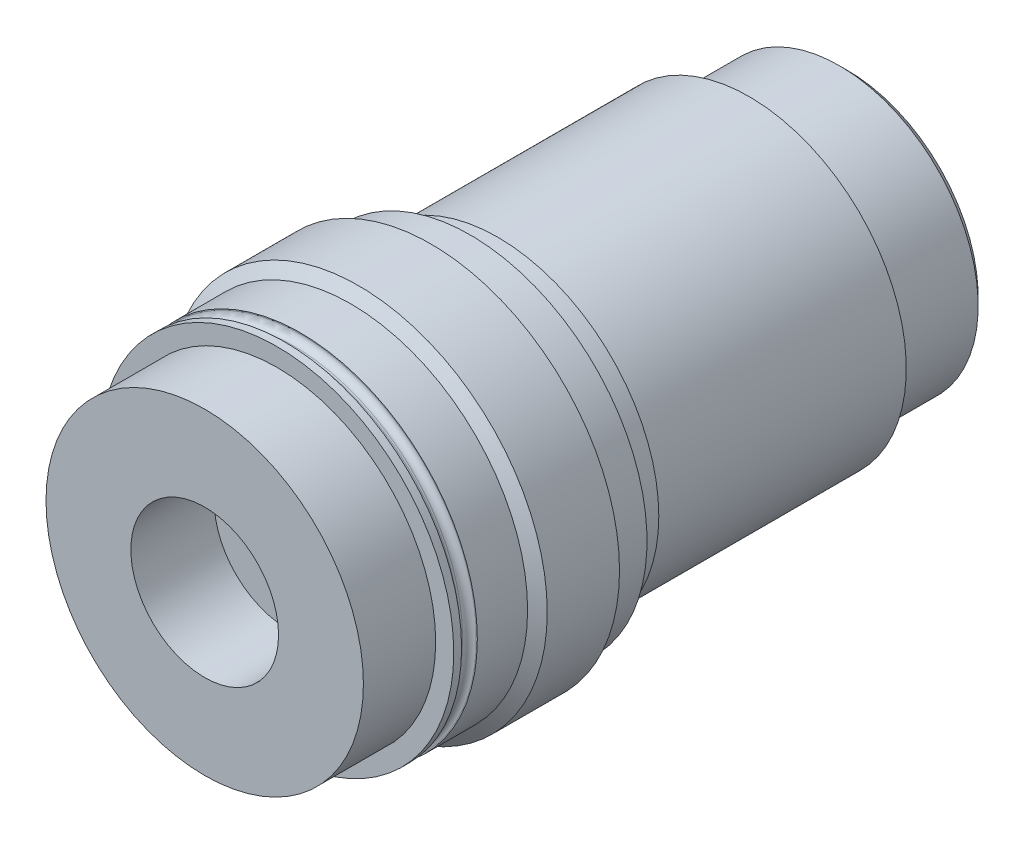
ISO-10303-21;
HEADER;
FILE_DESCRIPTION(('STEP AP214'),'2;1');
FILE_NAME('part.step','',(''),(''),'','','');
FILE_SCHEMA(('AUTOMOTIVE_DESIGN { 1 0 10303 214 1 1 1 1 }'));
ENDSEC;
DATA;
#1=APPLICATION_CONTEXT('core data for automotive mechanical design processes');
#2=APPLICATION_PROTOCOL_DEFINITION('international standard','automotive_design',2000,#1);
#3=PRODUCT_CONTEXT('',#1,'mechanical');
#4=PRODUCT('Part','Part','',(#3));
#5=PRODUCT_RELATED_PRODUCT_CATEGORY('part','',(#4));
#6=PRODUCT_DEFINITION_FORMATION('','',#4);
#7=PRODUCT_DEFINITION_CONTEXT('part definition',#1,'design');
#8=PRODUCT_DEFINITION('design','',#6,#7);
#9=PRODUCT_DEFINITION_SHAPE('','',#8);
#10=(LENGTH_UNIT() NAMED_UNIT(*) SI_UNIT(.MILLI.,.METRE.));
#11=(NAMED_UNIT(*) PLANE_ANGLE_UNIT() SI_UNIT($,.RADIAN.));
#12=(NAMED_UNIT(*) SI_UNIT($,.STERADIAN.) SOLID_ANGLE_UNIT());
#13=UNCERTAINTY_MEASURE_WITH_UNIT(LENGTH_MEASURE(1.E-05),#10,'distance_accuracy_value','');
#14=(GEOMETRIC_REPRESENTATION_CONTEXT(3) GLOBAL_UNCERTAINTY_ASSIGNED_CONTEXT((#13)) GLOBAL_UNIT_ASSIGNED_CONTEXT((#10,
#11,#12)) REPRESENTATION_CONTEXT('',''));
#15=CARTESIAN_POINT('',(0.,0.,0.));
#16=DIRECTION('',(0.,0.,1.));
#17=DIRECTION('',(1.,0.,0.));
#18=AXIS2_PLACEMENT_3D('',#15,#16,#17);
#19=CARTESIAN_POINT('',(60.0000008940697,0.,42.9));
#20=DIRECTION('',(0.,0.,1.));
#21=DIRECTION('',(1.,0.,0.));
#22=AXIS2_PLACEMENT_3D('',#19,#20,#21);
#23=PLANE('',#22);
#24=CARTESIAN_POINT('',(60.0000008940697,0.,42.9));
#25=DIRECTION('',(0.,0.,-1.));
#26=DIRECTION('',(-1.,0.,0.));
#27=AXIS2_PLACEMENT_3D('',#24,#25,#26);
#28=CIRCLE('',#27,4.7);
#29=CARTESIAN_POINT('',(64.7000008940697,0.,42.9));
#30=VERTEX_POINT('',#29);
#31=EDGE_CURVE('E254',#30,#30,#28,.T.);
#32=ORIENTED_EDGE('',*,*,#31,.T.);
#33=EDGE_LOOP('',(#32));
#34=FACE_BOUND('',#33,.T.);
#35=CARTESIAN_POINT('',(60.0000008940697,0.,42.9));
#36=DIRECTION('',(0.,0.,1.));
#37=DIRECTION('',(-1.,0.,0.));
#38=AXIS2_PLACEMENT_3D('',#35,#36,#37);
#39=CIRCLE('',#38,10.1);
#40=CARTESIAN_POINT('',(70.1000008940697,0.,42.9));
#41=VERTEX_POINT('',#40);
#42=EDGE_CURVE('E244',#41,#41,#39,.T.);
#43=ORIENTED_EDGE('',*,*,#42,.T.);
#44=EDGE_LOOP('',(#43));
#45=FACE_BOUND('',#44,.T.);
#46=ADVANCED_FACE('F16',(#34,#45),#23,.T.);
#47=CARTESIAN_POINT('',(60.0000008940697,0.,38.3));
#48=DIRECTION('',(0.,0.,1.));
#49=DIRECTION('',(1.,0.,0.));
#50=AXIS2_PLACEMENT_3D('',#47,#48,#49);
#51=PLANE('',#50);
#52=CARTESIAN_POINT('',(60.0000008940697,0.,38.3));
#53=DIRECTION('',(0.,0.,1.));
#54=DIRECTION('',(-1.,0.,0.));
#55=AXIS2_PLACEMENT_3D('',#52,#53,#54);
#56=CIRCLE('',#55,10.1);
#57=CARTESIAN_POINT('',(70.1000008940697,0.,38.3));
#58=VERTEX_POINT('',#57);
#59=EDGE_CURVE('E11',#58,#58,#56,.T.);
#60=ORIENTED_EDGE('',*,*,#59,.F.);
#61=EDGE_LOOP('',(#60));
#62=FACE_BOUND('',#61,.T.);
#63=CARTESIAN_POINT('',(60.0000008940697,0.,38.3));
#64=DIRECTION('',(0.,0.,1.));
#65=DIRECTION('',(-1.,0.,0.));
#66=AXIS2_PLACEMENT_3D('',#63,#64,#65);
#67=CIRCLE('',#66,11.25);
#68=CARTESIAN_POINT('',(71.2500008940697,0.,38.3));
#69=VERTEX_POINT('',#68);
#70=EDGE_CURVE('E255',#69,#69,#67,.T.);
#71=ORIENTED_EDGE('',*,*,#70,.T.);
#72=EDGE_LOOP('',(#71));
#73=FACE_BOUND('',#72,.T.);
#74=ADVANCED_FACE('F560',(#62,#73),#51,.T.);
#75=CARTESIAN_POINT('',(60.0000008940697,0.,42.9));
#76=DIRECTION('',(0.,0.,-1.));
#77=DIRECTION('',(-1.,0.,0.));
#78=AXIS2_PLACEMENT_3D('',#75,#76,#77);
#79=CYLINDRICAL_SURFACE('',#78,10.1);
#80=ORIENTED_EDGE('',*,*,#42,.F.);
#81=DIRECTION('',(0.,0.,-1.));
#82=VECTOR('',#81,1.);
#83=CARTESIAN_POINT('',(70.1000008940697,0.,42.9));
#84=LINE('',#83,#82);
#85=EDGE_CURVE('E27',#41,#58,#84,.T.);
#86=ORIENTED_EDGE('',*,*,#85,.T.);
#87=ORIENTED_EDGE('',*,*,#59,.T.);
#88=ORIENTED_EDGE('',*,*,#85,.F.);
#89=EDGE_LOOP('',(#80,#86,#87,#88));
#90=FACE_BOUND('',#89,.T.);
#91=ADVANCED_FACE('F555',(#90),#79,.T.);
#92=CARTESIAN_POINT('',(60.0000008940697,0.,37.594));
#93=DIRECTION('',(0.,0.,1.));
#94=DIRECTION('',(1.,0.,0.));
#95=AXIS2_PLACEMENT_3D('',#92,#93,#94);
#96=PLANE('',#95);
#97=CARTESIAN_POINT('',(60.0000008940697,0.,37.594));
#98=DIRECTION('',(0.,0.,-1.));
#99=DIRECTION('',(-1.,0.,0.));
#100=AXIS2_PLACEMENT_3D('',#97,#98,#99);
#101=CIRCLE('',#100,4.7);
#102=CARTESIAN_POINT('',(64.7000008940697,0.,37.594));
#103=VERTEX_POINT('',#102);
#104=EDGE_CURVE('E280',#103,#103,#101,.T.);
#105=ORIENTED_EDGE('',*,*,#104,.F.);
#106=EDGE_LOOP('',(#105));
#107=FACE_BOUND('',#106,.T.);
#108=ADVANCED_FACE('F546',(#107),#96,.T.);
#109=CARTESIAN_POINT('',(60.0000008940697,0.,42.9));
#110=DIRECTION('',(0.,0.,-1.));
#111=DIRECTION('',(-1.,0.,0.));
#112=AXIS2_PLACEMENT_3D('',#109,#110,#111);
#113=CYLINDRICAL_SURFACE('',#112,4.7);
#114=ORIENTED_EDGE('',*,*,#31,.F.);
#115=DIRECTION('',(0.,0.,-1.));
#116=VECTOR('',#115,1.);
#117=CARTESIAN_POINT('',(64.7000008940697,0.,42.9));
#118=LINE('',#117,#116);
#119=EDGE_CURVE('E266',#30,#103,#118,.T.);
#120=ORIENTED_EDGE('',*,*,#119,.T.);
#121=ORIENTED_EDGE('',*,*,#104,.T.);
#122=ORIENTED_EDGE('',*,*,#119,.F.);
#123=EDGE_LOOP('',(#114,#120,#121,#122));
#124=FACE_BOUND('',#123,.T.);
#125=ADVANCED_FACE('F540',(#124),#113,.F.);
#126=CARTESIAN_POINT('',(60.0000008940697,0.,42.9));
#127=DIRECTION('',(0.,0.,-1.));
#128=DIRECTION('',(-1.,0.,0.));
#129=AXIS2_PLACEMENT_3D('',#126,#127,#128);
#130=CYLINDRICAL_SURFACE('',#129,11.25);
#131=ORIENTED_EDGE('',*,*,#70,.F.);
#132=DIRECTION('',(0.,0.,-1.));
#133=VECTOR('',#132,1.);
#134=CARTESIAN_POINT('',(71.2500008940697,0.,42.9));
#135=LINE('',#134,#133);
#136=CARTESIAN_POINT('',(71.2500008940697,0.,37.8));
#137=VERTEX_POINT('',#136);
#138=EDGE_CURVE('E251',#69,#137,#135,.T.);
#139=ORIENTED_EDGE('',*,*,#138,.T.);
#140=CARTESIAN_POINT('',(60.0000008940697,0.,37.8));
#141=DIRECTION('',(0.,0.,1.));
#142=DIRECTION('',(-1.,0.,0.));
#143=AXIS2_PLACEMENT_3D('',#140,#141,#142);
#144=CIRCLE('',#143,11.25);
#145=EDGE_CURVE('E202',#137,#137,#144,.T.);
#146=ORIENTED_EDGE('',*,*,#145,.T.);
#147=ORIENTED_EDGE('',*,*,#138,.F.);
#148=EDGE_LOOP('',(#131,#139,#146,#147));
#149=FACE_BOUND('',#148,.T.);
#150=ADVANCED_FACE('F545',(#149),#130,.T.);
#151=CARTESIAN_POINT('',(60.0000008940697,0.,33.35));
#152=DIRECTION('',(0.,0.,-1.));
#153=DIRECTION('',(1.,0.,0.));
#154=AXIS2_PLACEMENT_3D('',#151,#152,#153);
#155=CONICAL_SURFACE('',#154,11.625,0.982793723247332);
#156=CARTESIAN_POINT('',(60.0000008940697,0.,33.1));
#157=DIRECTION('',(0.,0.,1.));
#158=DIRECTION('',(1.,0.,0.));
#159=AXIS2_PLACEMENT_3D('',#156,#157,#158);
#160=CIRCLE('',#159,12.);
#161=CARTESIAN_POINT('',(48.0000008940697,0.,33.1));
#162=VERTEX_POINT('',#161);
#163=EDGE_CURVE('E198',#162,#162,#160,.T.);
#164=ORIENTED_EDGE('',*,*,#163,.T.);
#165=DIRECTION('',(0.832050294337845,0.,0.554700196225227));
#166=VECTOR('',#165,1.);
#167=CARTESIAN_POINT('',(48.3750008940697,0.,33.35));
#168=LINE('',#167,#166);
#169=CARTESIAN_POINT('',(48.7500008940697,0.,33.6));
#170=VERTEX_POINT('',#169);
#171=EDGE_CURVE('E220',#162,#170,#168,.T.);
#172=ORIENTED_EDGE('',*,*,#171,.T.);
#173=CARTESIAN_POINT('',(60.0000008940697,0.,33.6));
#174=DIRECTION('',(0.,0.,1.));
#175=DIRECTION('',(-1.,0.,0.));
#176=AXIS2_PLACEMENT_3D('',#173,#174,#175);
#177=CIRCLE('',#176,11.25);
#178=CARTESIAN_POINT('',(71.2500008940697,0.,33.6));
#179=VERTEX_POINT('',#178);
#180=EDGE_CURVE('E216',#179,#170,#177,.T.);
#181=ORIENTED_EDGE('',*,*,#180,.F.);
#182=CARTESIAN_POINT('',(60.0000008940697,0.,33.6));
#183=DIRECTION('',(0.,0.,1.));
#184=DIRECTION('',(-1.,0.,0.));
#185=AXIS2_PLACEMENT_3D('',#182,#183,#184);
#186=CIRCLE('',#185,11.25);
#187=EDGE_CURVE('E217',#170,#179,#186,.T.);
#188=ORIENTED_EDGE('',*,*,#187,.F.);
#189=ORIENTED_EDGE('',*,*,#171,.F.);
#190=EDGE_LOOP('',(#164,#172,#181,#188,#189));
#191=FACE_BOUND('',#190,.T.);
#192=ADVANCED_FACE('F376',(#191),#155,.T.);
#193=CARTESIAN_POINT('',(60.0000008940697,0.,42.9));
#194=DIRECTION('',(0.,0.,-1.));
#195=DIRECTION('',(-1.,0.,0.));
#196=AXIS2_PLACEMENT_3D('',#193,#194,#195);
#197=CYLINDRICAL_SURFACE('',#196,11.25);
#198=CARTESIAN_POINT('',(60.0000008940697,0.,36.8));
#199=DIRECTION('',(0.,0.,-1.));
#200=DIRECTION('',(-1.,0.,0.));
#201=AXIS2_PLACEMENT_3D('',#198,#199,#200);
#202=CIRCLE('',#201,11.25);
#203=CARTESIAN_POINT('',(71.2500008940697,0.,36.8));
#204=VERTEX_POINT('',#203);
#205=EDGE_CURVE('E240',#204,#204,#202,.T.);
#206=ORIENTED_EDGE('',*,*,#205,.T.);
#207=DIRECTION('',(0.,0.,-1.));
#208=VECTOR('',#207,1.);
#209=CARTESIAN_POINT('',(71.2500008940697,0.,42.9));
#210=LINE('',#209,#208);
#211=EDGE_CURVE('E212',#204,#179,#210,.T.);
#212=ORIENTED_EDGE('',*,*,#211,.T.);
#213=ORIENTED_EDGE('',*,*,#180,.T.);
#214=ORIENTED_EDGE('',*,*,#187,.T.);
#215=ORIENTED_EDGE('',*,*,#211,.F.);
#216=EDGE_LOOP('',(#206,#212,#213,#214,#215));
#217=FACE_BOUND('',#216,.T.);
#218=ADVANCED_FACE('F371',(#217),#197,.T.);
#219=CARTESIAN_POINT('',(60.0000008940697,0.,37.8));
#220=DIRECTION('',(0.,0.,1.));
#221=DIRECTION('',(1.,0.,0.));
#222=AXIS2_PLACEMENT_3D('',#219,#220,#221);
#223=PLANE('',#222);
#224=CARTESIAN_POINT('',(60.0000008940697,0.,37.8));
#225=DIRECTION('',(0.,0.,-1.));
#226=DIRECTION('',(-1.,0.,0.));
#227=AXIS2_PLACEMENT_3D('',#224,#225,#226);
#228=CIRCLE('',#227,11.189);
#229=CARTESIAN_POINT('',(71.1890008940697,0.,37.8));
#230=VERTEX_POINT('',#229);
#231=EDGE_CURVE('E203',#230,#230,#228,.T.);
#232=ORIENTED_EDGE('',*,*,#231,.F.);
#233=EDGE_LOOP('',(#232));
#234=FACE_BOUND('',#233,.T.);
#235=ORIENTED_EDGE('',*,*,#145,.F.);
#236=EDGE_LOOP('',(#235));
#237=FACE_BOUND('',#236,.T.);
#238=ADVANCED_FACE('F594',(#234,#237),#223,.F.);
#239=CARTESIAN_POINT('',(60.0000008940697,0.,37.361));
#240=DIRECTION('',(0.,0.,-1.));
#241=DIRECTION('',(-1.,0.,0.));
#242=AXIS2_PLACEMENT_3D('',#239,#240,#241);
#243=TOROIDAL_SURFACE('',#242,11.189,0.439);
#244=ORIENTED_EDGE('',*,*,#231,.T.);
#245=CARTESIAN_POINT('',(71.1890008940697,0.,37.361));
#246=DIRECTION('',(0.,-1.,0.));
#247=DIRECTION('',(1.,0.,0.));
#248=AXIS2_PLACEMENT_3D('',#245,#246,#247);
#249=CIRCLE('',#248,0.439);
#250=CARTESIAN_POINT('',(70.7500008940697,0.,37.361));
#251=VERTEX_POINT('',#250);
#252=EDGE_CURVE('E199',#230,#251,#249,.T.);
#253=ORIENTED_EDGE('',*,*,#252,.T.);
#254=CARTESIAN_POINT('',(60.0000008940697,0.,37.361));
#255=DIRECTION('',(0.,0.,1.));
#256=DIRECTION('',(-1.,0.,0.));
#257=AXIS2_PLACEMENT_3D('',#254,#255,#256);
#258=CIRCLE('',#257,10.75);
#259=EDGE_CURVE('E241',#251,#251,#258,.T.);
#260=ORIENTED_EDGE('',*,*,#259,.T.);
#261=ORIENTED_EDGE('',*,*,#252,.F.);
#262=EDGE_LOOP('',(#244,#253,#260,#261));
#263=FACE_BOUND('',#262,.T.);
#264=ADVANCED_FACE('F359',(#263),#243,.F.);
#265=CARTESIAN_POINT('',(60.0000008940697,0.,36.8));
#266=DIRECTION('',(0.,0.,1.));
#267=DIRECTION('',(1.,0.,0.));
#268=AXIS2_PLACEMENT_3D('',#265,#266,#267);
#269=PLANE('',#268);
#270=CARTESIAN_POINT('',(60.0000008940697,0.,36.8));
#271=DIRECTION('',(0.,0.,1.));
#272=DIRECTION('',(-1.,0.,0.));
#273=AXIS2_PLACEMENT_3D('',#270,#271,#272);
#274=CIRCLE('',#273,11.189);
#275=CARTESIAN_POINT('',(48.8110008940697,0.,36.8));
#276=VERTEX_POINT('',#275);
#277=EDGE_CURVE('E232',#276,#276,#274,.T.);
#278=ORIENTED_EDGE('',*,*,#277,.F.);
#279=EDGE_LOOP('',(#278));
#280=FACE_BOUND('',#279,.T.);
#281=ORIENTED_EDGE('',*,*,#205,.F.);
#282=EDGE_LOOP('',(#281));
#283=FACE_BOUND('',#282,.T.);
#284=ADVANCED_FACE('F364',(#280,#283),#269,.T.);
#285=CARTESIAN_POINT('',(60.0000008940697,0.,37.8));
#286=DIRECTION('',(0.,0.,-1.));
#287=DIRECTION('',(-1.,0.,0.));
#288=AXIS2_PLACEMENT_3D('',#285,#286,#287);
#289=CYLINDRICAL_SURFACE('',#288,10.75);
#290=ORIENTED_EDGE('',*,*,#259,.F.);
#291=DIRECTION('',(0.,0.,-1.));
#292=VECTOR('',#291,1.);
#293=CARTESIAN_POINT('',(70.7500008940697,0.,37.8));
#294=LINE('',#293,#292);
#295=CARTESIAN_POINT('',(70.7500008940697,0.,37.239));
#296=VERTEX_POINT('',#295);
#297=EDGE_CURVE('E99',#251,#296,#294,.T.);
#298=ORIENTED_EDGE('',*,*,#297,.T.);
#299=CARTESIAN_POINT('',(60.0000008940697,0.,37.239));
#300=DIRECTION('',(0.,0.,-1.));
#301=DIRECTION('',(-1.,0.,0.));
#302=AXIS2_PLACEMENT_3D('',#299,#300,#301);
#303=CIRCLE('',#302,10.75);
#304=CARTESIAN_POINT('',(49.2500008940697,0.,37.239));
#305=VERTEX_POINT('',#304);
#306=EDGE_CURVE('E237',#305,#296,#303,.T.);
#307=ORIENTED_EDGE('',*,*,#306,.F.);
#308=CARTESIAN_POINT('',(60.0000008940697,0.,37.239));
#309=DIRECTION('',(0.,0.,-1.));
#310=DIRECTION('',(-1.,0.,0.));
#311=AXIS2_PLACEMENT_3D('',#308,#309,#310);
#312=CIRCLE('',#311,10.75);
#313=EDGE_CURVE('E87',#296,#305,#312,.T.);
#314=ORIENTED_EDGE('',*,*,#313,.F.);
#315=ORIENTED_EDGE('',*,*,#297,.F.);
#316=EDGE_LOOP('',(#290,#298,#307,#314,#315));
#317=FACE_BOUND('',#316,.T.);
#318=ADVANCED_FACE('F360',(#317),#289,.T.);
#319=CARTESIAN_POINT('',(60.0000008940697,0.,37.239));
#320=DIRECTION('',(0.,0.,1.));
#321=DIRECTION('',(1.,0.,0.));
#322=AXIS2_PLACEMENT_3D('',#319,#320,#321);
#323=TOROIDAL_SURFACE('',#322,11.189,0.439);
#324=ORIENTED_EDGE('',*,*,#277,.T.);
#325=CARTESIAN_POINT('',(48.8110008940697,0.,37.239));
#326=DIRECTION('',(0.,-1.,0.));
#327=DIRECTION('',(-1.,0.,0.));
#328=AXIS2_PLACEMENT_3D('',#325,#326,#327);
#329=CIRCLE('',#328,0.439);
#330=EDGE_CURVE('E233',#276,#305,#329,.T.);
#331=ORIENTED_EDGE('',*,*,#330,.T.);
#332=ORIENTED_EDGE('',*,*,#306,.T.);
#333=ORIENTED_EDGE('',*,*,#313,.T.);
#334=ORIENTED_EDGE('',*,*,#330,.F.);
#335=EDGE_LOOP('',(#324,#331,#332,#333,#334));
#336=FACE_BOUND('',#335,.T.);
#337=ADVANCED_FACE('F361',(#336),#323,.F.);
#338=CARTESIAN_POINT('',(60.0000008940697,0.,0.));
#339=DIRECTION('',(0.,0.,1.));
#340=DIRECTION('',(1.,0.,0.));
#341=AXIS2_PLACEMENT_3D('',#338,#339,#340);
#342=CYLINDRICAL_SURFACE('',#341,11.25);
#343=CARTESIAN_POINT('',(60.0000008940697,0.,26.));
#344=DIRECTION('',(0.,0.,1.));
#345=DIRECTION('',(1.,0.,0.));
#346=AXIS2_PLACEMENT_3D('',#343,#344,#345);
#347=CIRCLE('',#346,11.25);
#348=CARTESIAN_POINT('',(48.7500008940697,0.,26.));
#349=VERTEX_POINT('',#348);
#350=EDGE_CURVE('E228',#349,#349,#347,.T.);
#351=ORIENTED_EDGE('',*,*,#350,.T.);
#352=DIRECTION('',(0.,0.,1.));
#353=VECTOR('',#352,1.);
#354=CARTESIAN_POINT('',(48.7500008940697,0.,0.));
#355=LINE('',#354,#353);
#356=CARTESIAN_POINT('',(48.7500008940697,0.,28.));
#357=VERTEX_POINT('',#356);
#358=EDGE_CURVE('E149',#349,#357,#355,.T.);
#359=ORIENTED_EDGE('',*,*,#358,.T.);
#360=CARTESIAN_POINT('',(60.0000008940697,0.,28.));
#361=DIRECTION('',(0.,0.,-1.));
#362=DIRECTION('',(1.,0.,0.));
#363=AXIS2_PLACEMENT_3D('',#360,#361,#362);
#364=CIRCLE('',#363,11.25);
#365=EDGE_CURVE('E322',#357,#357,#364,.T.);
#366=ORIENTED_EDGE('',*,*,#365,.T.);
#367=ORIENTED_EDGE('',*,*,#358,.F.);
#368=EDGE_LOOP('',(#351,#359,#366,#367));
#369=FACE_BOUND('',#368,.T.);
#370=ADVANCED_FACE('F701',(#369),#342,.T.);
#371=CARTESIAN_POINT('',(60.0000008940697,0.,0.));
#372=DIRECTION('',(0.,0.,1.));
#373=DIRECTION('',(1.,0.,0.));
#374=AXIS2_PLACEMENT_3D('',#371,#372,#373);
#375=CYLINDRICAL_SURFACE('',#374,12.);
#376=ORIENTED_EDGE('',*,*,#163,.F.);
#377=DIRECTION('',(0.,0.,-1.));
#378=VECTOR('',#377,1.);
#379=CARTESIAN_POINT('',(48.0000008940697,0.,0.));
#380=LINE('',#379,#378);
#381=CARTESIAN_POINT('',(48.0000008940697,0.,28.5));
#382=VERTEX_POINT('',#381);
#383=EDGE_CURVE('E140',#162,#382,#380,.T.);
#384=ORIENTED_EDGE('',*,*,#383,.T.);
#385=CARTESIAN_POINT('',(60.0000008940697,0.,28.5));
#386=DIRECTION('',(0.,0.,-1.));
#387=DIRECTION('',(1.,0.,0.));
#388=AXIS2_PLACEMENT_3D('',#385,#386,#387);
#389=CIRCLE('',#388,12.);
#390=EDGE_CURVE('E269',#382,#382,#389,.T.);
#391=ORIENTED_EDGE('',*,*,#390,.F.);
#392=ORIENTED_EDGE('',*,*,#383,.F.);
#393=EDGE_LOOP('',(#376,#384,#391,#392));
#394=FACE_BOUND('',#393,.T.);
#395=ADVANCED_FACE('F377',(#394),#375,.T.);
#396=CARTESIAN_POINT('',(60.0000008940697,0.,28.25));
#397=DIRECTION('',(0.,0.,1.));
#398=DIRECTION('',(1.,0.,0.));
#399=AXIS2_PLACEMENT_3D('',#396,#397,#398);
#400=CONICAL_SURFACE('',#399,11.625,0.982793723247332);
#401=ORIENTED_EDGE('',*,*,#390,.T.);
#402=DIRECTION('',(0.832050294337845,0.,-0.554700196225227));
#403=VECTOR('',#402,1.);
#404=CARTESIAN_POINT('',(48.3750008940697,0.,28.25));
#405=LINE('',#404,#403);
#406=EDGE_CURVE('E319',#382,#357,#405,.T.);
#407=ORIENTED_EDGE('',*,*,#406,.T.);
#408=ORIENTED_EDGE('',*,*,#365,.F.);
#409=ORIENTED_EDGE('',*,*,#406,.F.);
#410=EDGE_LOOP('',(#401,#407,#408,#409));
#411=FACE_BOUND('',#410,.T.);
#412=ADVANCED_FACE('F577',(#411),#400,.T.);
#413=CARTESIAN_POINT('',(60.0000008940697,0.,26.));
#414=DIRECTION('',(0.,0.,-1.));
#415=DIRECTION('',(0.,-1.,0.));
#416=AXIS2_PLACEMENT_3D('',#413,#414,#415);
#417=PLANE('',#416);
#418=CARTESIAN_POINT('',(60.0000008940697,0.,26.));
#419=DIRECTION('',(0.,0.,-1.));
#420=DIRECTION('',(1.,0.,0.));
#421=AXIS2_PLACEMENT_3D('',#418,#419,#420);
#422=CIRCLE('',#421,10.25);
#423=CARTESIAN_POINT('',(49.7500008940697,0.,26.));
#424=VERTEX_POINT('',#423);
#425=EDGE_CURVE('E225',#424,#424,#422,.T.);
#426=ORIENTED_EDGE('',*,*,#425,.F.);
#427=EDGE_LOOP('',(#426));
#428=FACE_BOUND('',#427,.T.);
#429=ORIENTED_EDGE('',*,*,#350,.F.);
#430=EDGE_LOOP('',(#429));
#431=FACE_BOUND('',#430,.T.);
#432=ADVANCED_FACE('F582',(#428,#431),#417,.T.);
#433=CARTESIAN_POINT('',(60.0000008940697,0.,0.));
#434=DIRECTION('',(0.,0.,1.));
#435=DIRECTION('',(1.,0.,0.));
#436=AXIS2_PLACEMENT_3D('',#433,#434,#435);
#437=CYLINDRICAL_SURFACE('',#436,10.25);
#438=CARTESIAN_POINT('',(60.0000008940697,0.,24.25));
#439=DIRECTION('',(0.,0.,1.));
#440=DIRECTION('',(1.,0.,0.));
#441=AXIS2_PLACEMENT_3D('',#438,#439,#440);
#442=CIRCLE('',#441,10.25);
#443=CARTESIAN_POINT('',(49.7500008940697,0.,24.25));
#444=VERTEX_POINT('',#443);
#445=EDGE_CURVE('E207',#444,#444,#442,.T.);
#446=ORIENTED_EDGE('',*,*,#445,.T.);
#447=DIRECTION('',(0.,0.,1.));
#448=VECTOR('',#447,1.);
#449=CARTESIAN_POINT('',(49.7500008940697,0.,0.));
#450=LINE('',#449,#448);
#451=EDGE_CURVE('E229',#444,#424,#450,.T.);
#452=ORIENTED_EDGE('',*,*,#451,.T.);
#453=ORIENTED_EDGE('',*,*,#425,.T.);
#454=ORIENTED_EDGE('',*,*,#451,.F.);
#455=EDGE_LOOP('',(#446,#452,#453,#454));
#456=FACE_BOUND('',#455,.T.);
#457=ADVANCED_FACE('F663',(#456),#437,.T.);
#458=CARTESIAN_POINT('',(60.0000008940697,0.,24.25));
#459=DIRECTION('',(0.,0.,-1.));
#460=DIRECTION('',(0.,-1.,0.));
#461=AXIS2_PLACEMENT_3D('',#458,#459,#460);
#462=PLANE('',#461);
#463=CARTESIAN_POINT('',(60.0000008940697,0.,24.25));
#464=DIRECTION('',(0.,0.,-1.));
#465=DIRECTION('',(1.,0.,0.));
#466=AXIS2_PLACEMENT_3D('',#463,#464,#465);
#467=CIRCLE('',#466,10.);
#468=CARTESIAN_POINT('',(50.0000008940697,0.,24.25));
#469=VERTEX_POINT('',#468);
#470=EDGE_CURVE('E204',#469,#469,#467,.T.);
#471=ORIENTED_EDGE('',*,*,#470,.F.);
#472=EDGE_LOOP('',(#471));
#473=FACE_BOUND('',#472,.T.);
#474=ORIENTED_EDGE('',*,*,#445,.F.);
#475=EDGE_LOOP('',(#474));
#476=FACE_BOUND('',#475,.T.);
#477=ADVANCED_FACE('F18',(#473,#476),#462,.T.);
#478=CARTESIAN_POINT('',(60.0000008940697,0.,0.));
#479=DIRECTION('',(0.,0.,1.));
#480=DIRECTION('',(1.,0.,0.));
#481=AXIS2_PLACEMENT_3D('',#478,#479,#480);
#482=CYLINDRICAL_SURFACE('',#481,10.);
#483=CARTESIAN_POINT('',(60.0000008940697,0.,8.25));
#484=DIRECTION('',(0.,0.,1.));
#485=DIRECTION('',(1.,0.,0.));
#486=AXIS2_PLACEMENT_3D('',#483,#484,#485);
#487=CIRCLE('',#486,10.);
#488=CARTESIAN_POINT('',(50.0000008940697,0.,8.25));
#489=VERTEX_POINT('',#488);
#490=EDGE_CURVE('E224',#489,#489,#487,.T.);
#491=ORIENTED_EDGE('',*,*,#490,.T.);
#492=DIRECTION('',(0.,0.,1.));
#493=VECTOR('',#492,1.);
#494=CARTESIAN_POINT('',(50.0000008940697,0.,0.));
#495=LINE('',#494,#493);
#496=EDGE_CURVE('E208',#489,#469,#495,.T.);
#497=ORIENTED_EDGE('',*,*,#496,.T.);
#498=ORIENTED_EDGE('',*,*,#470,.T.);
#499=ORIENTED_EDGE('',*,*,#496,.F.);
#500=EDGE_LOOP('',(#491,#497,#498,#499));
#501=FACE_BOUND('',#500,.T.);
#502=ADVANCED_FACE('F531',(#501),#482,.T.);
#503=CARTESIAN_POINT('',(60.0000008940697,0.,8.25));
#504=DIRECTION('',(0.,0.,-1.));
#505=DIRECTION('',(0.,-1.,0.));
#506=AXIS2_PLACEMENT_3D('',#503,#504,#505);
#507=PLANE('',#506);
#508=CARTESIAN_POINT('',(60.0000008940697,0.,8.25));
#509=DIRECTION('',(0.,0.,-1.));
#510=DIRECTION('',(1.,0.,0.));
#511=AXIS2_PLACEMENT_3D('',#508,#509,#510);
#512=CIRCLE('',#511,8.825);
#513=CARTESIAN_POINT('',(51.1750008940697,0.,8.25));
#514=VERTEX_POINT('',#513);
#515=EDGE_CURVE('E189',#514,#514,#512,.T.);
#516=ORIENTED_EDGE('',*,*,#515,.F.);
#517=EDGE_LOOP('',(#516));
#518=FACE_BOUND('',#517,.T.);
#519=ORIENTED_EDGE('',*,*,#490,.F.);
#520=EDGE_LOOP('',(#519));
#521=FACE_BOUND('',#520,.T.);
#522=ADVANCED_FACE('F525',(#518,#521),#507,.T.);
#523=CARTESIAN_POINT('',(60.0000008940697,0.,0.));
#524=DIRECTION('',(0.,0.,1.));
#525=DIRECTION('',(1.,0.,0.));
#526=AXIS2_PLACEMENT_3D('',#523,#524,#525);
#527=CYLINDRICAL_SURFACE('',#526,8.825);
#528=CARTESIAN_POINT('',(60.0000008940697,0.,2.5));
#529=DIRECTION('',(0.,0.,-1.));
#530=DIRECTION('',(1.,0.,0.));
#531=AXIS2_PLACEMENT_3D('',#528,#529,#530);
#532=CIRCLE('',#531,8.825);
#533=CARTESIAN_POINT('',(51.1750008940697,0.,2.5));
#534=VERTEX_POINT('',#533);
#535=EDGE_CURVE('E191',#534,#534,#532,.T.);
#536=ORIENTED_EDGE('',*,*,#535,.F.);
#537=DIRECTION('',(0.,0.,1.));
#538=VECTOR('',#537,1.);
#539=CARTESIAN_POINT('',(51.1750008940697,0.,0.));
#540=LINE('',#539,#538);
#541=EDGE_CURVE('E181',#534,#514,#540,.T.);
#542=ORIENTED_EDGE('',*,*,#541,.T.);
#543=ORIENTED_EDGE('',*,*,#515,.T.);
#544=ORIENTED_EDGE('',*,*,#541,.F.);
#545=EDGE_LOOP('',(#536,#542,#543,#544));
#546=FACE_BOUND('',#545,.T.);
#547=ADVANCED_FACE('F530',(#546),#527,.T.);
#548=CARTESIAN_POINT('',(60.0000008940697,0.,2.));
#549=DIRECTION('',(0.,0.,-1.));
#550=DIRECTION('',(0.,-1.,0.));
#551=AXIS2_PLACEMENT_3D('',#548,#549,#550);
#552=PLANE('',#551);
#553=CARTESIAN_POINT('',(60.0000008940697,0.,2.));
#554=DIRECTION('',(0.,0.,-1.));
#555=DIRECTION('',(1.,0.,0.));
#556=AXIS2_PLACEMENT_3D('',#553,#554,#555);
#557=CIRCLE('',#556,5.5);
#558=CARTESIAN_POINT('',(54.5000008940697,0.,2.));
#559=VERTEX_POINT('',#558);
#560=EDGE_CURVE('E20',#559,#559,#557,.T.);
#561=ORIENTED_EDGE('',*,*,#560,.F.);
#562=EDGE_LOOP('',(#561));
#563=FACE_BOUND('',#562,.T.);
#564=CARTESIAN_POINT('',(60.0000008940697,0.,2.));
#565=DIRECTION('',(0.,0.,1.));
#566=DIRECTION('',(1.,0.,0.));
#567=AXIS2_PLACEMENT_3D('',#564,#565,#566);
#568=CIRCLE('',#567,8.325);
#569=CARTESIAN_POINT('',(51.6750008940697,0.,2.));
#570=VERTEX_POINT('',#569);
#571=EDGE_CURVE('E175',#570,#570,#568,.T.);
#572=ORIENTED_EDGE('',*,*,#571,.F.);
#573=EDGE_LOOP('',(#572));
#574=FACE_BOUND('',#573,.T.);
#575=ADVANCED_FACE('F570',(#563,#574),#552,.T.);
#576=CARTESIAN_POINT('',(60.0000008940697,0.,2.25));
#577=DIRECTION('',(0.,0.,1.));
#578=DIRECTION('',(1.,0.,0.));
#579=AXIS2_PLACEMENT_3D('',#576,#577,#578);
#580=CONICAL_SURFACE('',#579,8.575,0.785398163397447);
#581=ORIENTED_EDGE('',*,*,#535,.T.);
#582=DIRECTION('',(0.707106781186546,0.,-0.707106781186549));
#583=VECTOR('',#582,1.);
#584=CARTESIAN_POINT('',(51.4250008940697,0.,2.25));
#585=LINE('',#584,#583);
#586=EDGE_CURVE('E178',#534,#570,#585,.T.);
#587=ORIENTED_EDGE('',*,*,#586,.T.);
#588=ORIENTED_EDGE('',*,*,#571,.T.);
#589=ORIENTED_EDGE('',*,*,#586,.F.);
#590=EDGE_LOOP('',(#581,#587,#588,#589));
#591=FACE_BOUND('',#590,.T.);
#592=ADVANCED_FACE('F177',(#591),#580,.T.);
#593=CARTESIAN_POINT('',(60.0000008940697,0.,0.));
#594=DIRECTION('',(0.,0.,1.));
#595=DIRECTION('',(1.,0.,0.));
#596=AXIS2_PLACEMENT_3D('',#593,#594,#595);
#597=PLANE('',#596);
#598=CARTESIAN_POINT('',(60.0000008940697,0.,0.));
#599=DIRECTION('',(0.,0.,1.));
#600=DIRECTION('',(1.,0.,0.));
#601=AXIS2_PLACEMENT_3D('',#598,#599,#600);
#602=CIRCLE('',#601,2.5);
#603=CARTESIAN_POINT('',(57.5000008940697,0.,0.));
#604=VERTEX_POINT('',#603);
#605=EDGE_CURVE('E307',#604,#604,#602,.T.);
#606=ORIENTED_EDGE('',*,*,#605,.T.);
#607=EDGE_LOOP('',(#606));
#608=FACE_BOUND('',#607,.T.);
#609=CARTESIAN_POINT('',(60.0000008940697,0.,0.));
#610=DIRECTION('',(0.,0.,1.));
#611=DIRECTION('',(1.,0.,0.));
#612=AXIS2_PLACEMENT_3D('',#609,#610,#611);
#613=CIRCLE('',#612,4.5);
#614=CARTESIAN_POINT('',(55.5000008940697,0.,0.));
#615=VERTEX_POINT('',#614);
#616=EDGE_CURVE('E245',#615,#615,#613,.T.);
#617=ORIENTED_EDGE('',*,*,#616,.F.);
#618=EDGE_LOOP('',(#617));
#619=FACE_BOUND('',#618,.T.);
#620=ADVANCED_FACE('F488',(#608,#619),#597,.F.);
#621=CARTESIAN_POINT('',(60.0000008940697,0.,0.));
#622=DIRECTION('',(0.,0.,1.));
#623=DIRECTION('',(1.,0.,0.));
#624=AXIS2_PLACEMENT_3D('',#621,#622,#623);
#625=CYLINDRICAL_SURFACE('',#624,5.5);
#626=CARTESIAN_POINT('',(60.0000008940697,0.,1.));
#627=DIRECTION('',(0.,0.,-1.));
#628=DIRECTION('',(1.,0.,0.));
#629=AXIS2_PLACEMENT_3D('',#626,#627,#628);
#630=CIRCLE('',#629,5.5);
#631=CARTESIAN_POINT('',(54.5000008940697,0.,1.));
#632=VERTEX_POINT('',#631);
#633=EDGE_CURVE('E262',#632,#632,#630,.T.);
#634=ORIENTED_EDGE('',*,*,#633,.F.);
#635=DIRECTION('',(0.,0.,1.));
#636=VECTOR('',#635,1.);
#637=CARTESIAN_POINT('',(54.5000008940697,0.,0.));
#638=LINE('',#637,#636);
#639=EDGE_CURVE('E275',#632,#559,#638,.T.);
#640=ORIENTED_EDGE('',*,*,#639,.T.);
#641=ORIENTED_EDGE('',*,*,#560,.T.);
#642=ORIENTED_EDGE('',*,*,#639,.F.);
#643=EDGE_LOOP('',(#634,#640,#641,#642));
#644=FACE_BOUND('',#643,.T.);
#645=ADVANCED_FACE('F494',(#644),#625,.T.);
#646=CARTESIAN_POINT('',(60.0000008940697,0.,0.5));
#647=DIRECTION('',(0.,0.,1.));
#648=DIRECTION('',(1.,0.,0.));
#649=AXIS2_PLACEMENT_3D('',#646,#647,#648);
#650=CONICAL_SURFACE('',#649,5.,0.785398163397447);
#651=ORIENTED_EDGE('',*,*,#616,.T.);
#652=DIRECTION('',(-0.707106781186546,0.,0.707106781186549));
#653=VECTOR('',#652,1.);
#654=CARTESIAN_POINT('',(55.0000008940697,0.,0.5));
#655=LINE('',#654,#653);
#656=EDGE_CURVE('E249',#615,#632,#655,.T.);
#657=ORIENTED_EDGE('',*,*,#656,.T.);
#658=ORIENTED_EDGE('',*,*,#633,.T.);
#659=ORIENTED_EDGE('',*,*,#656,.F.);
#660=EDGE_LOOP('',(#651,#657,#658,#659));
#661=FACE_BOUND('',#660,.T.);
#662=ADVANCED_FACE('F506',(#661),#650,.T.);
#663=CARTESIAN_POINT('',(60.0000008940697,0.,0.1));
#664=DIRECTION('',(0.,0.,-1.));
#665=DIRECTION('',(0.,-1.,0.));
#666=AXIS2_PLACEMENT_3D('',#663,#664,#665);
#667=PLANE('',#666);
#668=CARTESIAN_POINT('',(60.0000008940697,0.,0.1));
#669=DIRECTION('',(0.,0.,1.));
#670=DIRECTION('',(1.,0.,0.));
#671=AXIS2_PLACEMENT_3D('',#668,#669,#670);
#672=CIRCLE('',#671,2.5);
#673=CARTESIAN_POINT('',(57.5000008940697,0.,0.1));
#674=VERTEX_POINT('',#673);
#675=EDGE_CURVE('E250',#674,#674,#672,.T.);
#676=ORIENTED_EDGE('',*,*,#675,.F.);
#677=EDGE_LOOP('',(#676));
#678=FACE_BOUND('',#677,.T.);
#679=ADVANCED_FACE('F517',(#678),#667,.T.);
#680=CARTESIAN_POINT('',(60.0000008940697,0.,0.));
#681=DIRECTION('',(0.,0.,1.));
#682=DIRECTION('',(1.,0.,0.));
#683=AXIS2_PLACEMENT_3D('',#680,#681,#682);
#684=CYLINDRICAL_SURFACE('',#683,2.5);
#685=ORIENTED_EDGE('',*,*,#605,.F.);
#686=DIRECTION('',(0.,0.,1.));
#687=VECTOR('',#686,1.);
#688=CARTESIAN_POINT('',(57.5000008940697,0.,0.));
#689=LINE('',#688,#687);
#690=EDGE_CURVE('E286',#604,#674,#689,.T.);
#691=ORIENTED_EDGE('',*,*,#690,.T.);
#692=ORIENTED_EDGE('',*,*,#675,.T.);
#693=ORIENTED_EDGE('',*,*,#690,.F.);
#694=EDGE_LOOP('',(#685,#691,#692,#693));
#695=FACE_BOUND('',#694,.T.);
#696=ADVANCED_FACE('F640',(#695),#684,.F.);
#697=CLOSED_SHELL('',(#46,#74,#91,#108,#125,#150,#192,#218,#238,#264,#284,#318,#337,#370,#395,
#412,#432,#457,#477,#502,#522,#547,#575,#592,#620,#645,#662,#679,#696));
#698=MANIFOLD_SOLID_BREP('B1',#697);
#699=ADVANCED_BREP_SHAPE_REPRESENTATION('',(#18,#698),#14);
#700=SHAPE_DEFINITION_REPRESENTATION(#9,#699);
ENDSEC;
END-ISO-10303-21;
